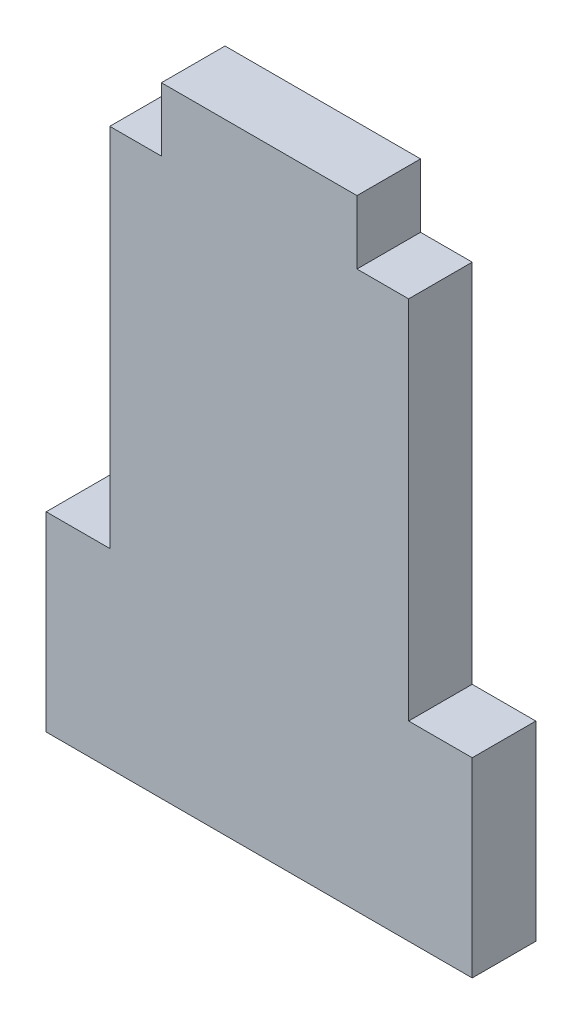
ISO-10303-21;
HEADER;
FILE_DESCRIPTION(('STEP AP214'),'2;1');
FILE_NAME('part.step','',(''),(''),'','','');
FILE_SCHEMA(('AUTOMOTIVE_DESIGN { 1 0 10303 214 1 1 1 1 }'));
ENDSEC;
DATA;
#1=APPLICATION_CONTEXT('core data for automotive mechanical design processes');
#2=APPLICATION_PROTOCOL_DEFINITION('international standard','automotive_design',2000,#1);
#3=PRODUCT_CONTEXT('',#1,'mechanical');
#4=PRODUCT('Part','Part','',(#3));
#5=PRODUCT_RELATED_PRODUCT_CATEGORY('part','',(#4));
#6=PRODUCT_DEFINITION_FORMATION('','',#4);
#7=PRODUCT_DEFINITION_CONTEXT('part definition',#1,'design');
#8=PRODUCT_DEFINITION('design','',#6,#7);
#9=PRODUCT_DEFINITION_SHAPE('','',#8);
#10=(LENGTH_UNIT() NAMED_UNIT(*) SI_UNIT(.MILLI.,.METRE.));
#11=(NAMED_UNIT(*) PLANE_ANGLE_UNIT() SI_UNIT($,.RADIAN.));
#12=(NAMED_UNIT(*) SI_UNIT($,.STERADIAN.) SOLID_ANGLE_UNIT());
#13=UNCERTAINTY_MEASURE_WITH_UNIT(LENGTH_MEASURE(1.E-05),#10,'distance_accuracy_value','');
#14=(GEOMETRIC_REPRESENTATION_CONTEXT(3) GLOBAL_UNCERTAINTY_ASSIGNED_CONTEXT((#13)) GLOBAL_UNIT_ASSIGNED_CONTEXT((#10,
#11,#12)) REPRESENTATION_CONTEXT('',''));
#15=CARTESIAN_POINT('',(0.,0.,0.));
#16=DIRECTION('',(0.,0.,1.));
#17=DIRECTION('',(1.,0.,0.));
#18=AXIS2_PLACEMENT_3D('',#15,#16,#17);
#19=CARTESIAN_POINT('',(-13.4,12.,4.));
#20=DIRECTION('',(0.,-1.,0.));
#21=DIRECTION('',(0.,0.,-1.));
#22=AXIS2_PLACEMENT_3D('',#19,#20,#21);
#23=PLANE('',#22);
#24=DIRECTION('',(-1.,0.,0.));
#25=VECTOR('',#24,1.);
#26=CARTESIAN_POINT('',(-13.4,12.,0.));
#27=LINE('',#26,#25);
#28=CARTESIAN_POINT('',(-9.4,12.,0.));
#29=VERTEX_POINT('',#28);
#30=CARTESIAN_POINT('',(-13.4,12.,0.));
#31=VERTEX_POINT('',#30);
#32=EDGE_CURVE('E153',#29,#31,#27,.T.);
#33=ORIENTED_EDGE('',*,*,#32,.T.);
#34=DIRECTION('',(0.,0.,-1.));
#35=VECTOR('',#34,1.);
#36=CARTESIAN_POINT('',(-13.4,12.,4.));
#37=LINE('',#36,#35);
#38=CARTESIAN_POINT('',(-13.4,12.,4.));
#39=VERTEX_POINT('',#38);
#40=EDGE_CURVE('E11',#39,#31,#37,.T.);
#41=ORIENTED_EDGE('',*,*,#40,.F.);
#42=DIRECTION('',(-1.,0.,0.));
#43=VECTOR('',#42,1.);
#44=CARTESIAN_POINT('',(-13.4,12.,4.));
#45=LINE('',#44,#43);
#46=CARTESIAN_POINT('',(-9.4,12.,4.));
#47=VERTEX_POINT('',#46);
#48=EDGE_CURVE('E175',#47,#39,#45,.T.);
#49=ORIENTED_EDGE('',*,*,#48,.F.);
#50=DIRECTION('',(0.,0.,-1.));
#51=VECTOR('',#50,1.);
#52=CARTESIAN_POINT('',(-9.4,12.,4.));
#53=LINE('',#52,#51);
#54=EDGE_CURVE('E149',#47,#29,#53,.T.);
#55=ORIENTED_EDGE('',*,*,#54,.T.);
#56=EDGE_LOOP('',(#33,#41,#49,#55));
#57=FACE_BOUND('',#56,.T.);
#58=ADVANCED_FACE('F33',(#57),#23,.F.);
#59=CARTESIAN_POINT('',(-13.4,0.,4.));
#60=DIRECTION('',(1.,0.,0.));
#61=DIRECTION('',(0.,0.,-1.));
#62=AXIS2_PLACEMENT_3D('',#59,#60,#61);
#63=PLANE('',#62);
#64=DIRECTION('',(0.,-1.,0.));
#65=VECTOR('',#64,1.);
#66=CARTESIAN_POINT('',(-13.4,0.,0.));
#67=LINE('',#66,#65);
#68=CARTESIAN_POINT('',(-13.4,0.,0.));
#69=VERTEX_POINT('',#68);
#70=EDGE_CURVE('E156',#31,#69,#67,.T.);
#71=ORIENTED_EDGE('',*,*,#70,.T.);
#72=DIRECTION('',(0.,0.,-1.));
#73=VECTOR('',#72,1.);
#74=CARTESIAN_POINT('',(-13.4,0.,4.));
#75=LINE('',#74,#73);
#76=CARTESIAN_POINT('',(-13.4,0.,4.));
#77=VERTEX_POINT('',#76);
#78=EDGE_CURVE('E41',#77,#69,#75,.T.);
#79=ORIENTED_EDGE('',*,*,#78,.F.);
#80=DIRECTION('',(0.,-1.,0.));
#81=VECTOR('',#80,1.);
#82=CARTESIAN_POINT('',(-13.4,0.,4.));
#83=LINE('',#82,#81);
#84=EDGE_CURVE('E104',#39,#77,#83,.T.);
#85=ORIENTED_EDGE('',*,*,#84,.F.);
#86=ORIENTED_EDGE('',*,*,#40,.T.);
#87=EDGE_LOOP('',(#71,#79,#85,#86));
#88=FACE_BOUND('',#87,.T.);
#89=ADVANCED_FACE('F253',(#88),#63,.F.);
#90=CARTESIAN_POINT('',(-13.4,0.,4.));
#91=DIRECTION('',(0.,1.,0.));
#92=DIRECTION('',(0.,0.,1.));
#93=AXIS2_PLACEMENT_3D('',#90,#91,#92);
#94=PLANE('',#93);
#95=DIRECTION('',(1.,0.,0.));
#96=VECTOR('',#95,1.);
#97=CARTESIAN_POINT('',(-13.4,0.,0.));
#98=LINE('',#97,#96);
#99=CARTESIAN_POINT('',(13.4,0.,0.));
#100=VERTEX_POINT('',#99);
#101=EDGE_CURVE('E158',#69,#100,#98,.T.);
#102=ORIENTED_EDGE('',*,*,#101,.T.);
#103=DIRECTION('',(0.,0.,-1.));
#104=VECTOR('',#103,1.);
#105=CARTESIAN_POINT('',(13.4,0.,4.));
#106=LINE('',#105,#104);
#107=CARTESIAN_POINT('',(13.4,0.,4.));
#108=VERTEX_POINT('',#107);
#109=EDGE_CURVE('E194',#108,#100,#106,.T.);
#110=ORIENTED_EDGE('',*,*,#109,.F.);
#111=DIRECTION('',(1.,0.,0.));
#112=VECTOR('',#111,1.);
#113=CARTESIAN_POINT('',(-13.4,0.,4.));
#114=LINE('',#113,#112);
#115=EDGE_CURVE('E202',#77,#108,#114,.T.);
#116=ORIENTED_EDGE('',*,*,#115,.F.);
#117=ORIENTED_EDGE('',*,*,#78,.T.);
#118=EDGE_LOOP('',(#102,#110,#116,#117));
#119=FACE_BOUND('',#118,.T.);
#120=ADVANCED_FACE('F200',(#119),#94,.F.);
#121=CARTESIAN_POINT('',(13.4,0.,4.));
#122=DIRECTION('',(-1.,0.,0.));
#123=DIRECTION('',(0.,0.,1.));
#124=AXIS2_PLACEMENT_3D('',#121,#122,#123);
#125=PLANE('',#124);
#126=DIRECTION('',(0.,1.,0.));
#127=VECTOR('',#126,1.);
#128=CARTESIAN_POINT('',(13.4,0.,0.));
#129=LINE('',#128,#127);
#130=CARTESIAN_POINT('',(13.4,12.,0.));
#131=VERTEX_POINT('',#130);
#132=EDGE_CURVE('E160',#100,#131,#129,.T.);
#133=ORIENTED_EDGE('',*,*,#132,.T.);
#134=DIRECTION('',(0.,0.,-1.));
#135=VECTOR('',#134,1.);
#136=CARTESIAN_POINT('',(13.4,12.,4.));
#137=LINE('',#136,#135);
#138=CARTESIAN_POINT('',(13.4,12.,4.));
#139=VERTEX_POINT('',#138);
#140=EDGE_CURVE('E191',#139,#131,#137,.T.);
#141=ORIENTED_EDGE('',*,*,#140,.F.);
#142=DIRECTION('',(0.,1.,0.));
#143=VECTOR('',#142,1.);
#144=CARTESIAN_POINT('',(13.4,0.,4.));
#145=LINE('',#144,#143);
#146=EDGE_CURVE('E220',#108,#139,#145,.T.);
#147=ORIENTED_EDGE('',*,*,#146,.F.);
#148=ORIENTED_EDGE('',*,*,#109,.T.);
#149=EDGE_LOOP('',(#133,#141,#147,#148));
#150=FACE_BOUND('',#149,.T.);
#151=ADVANCED_FACE('F211',(#150),#125,.F.);
#152=CARTESIAN_POINT('',(13.4,12.,4.));
#153=DIRECTION('',(0.,-1.,0.));
#154=DIRECTION('',(0.,0.,-1.));
#155=AXIS2_PLACEMENT_3D('',#152,#153,#154);
#156=PLANE('',#155);
#157=DIRECTION('',(-1.,0.,0.));
#158=VECTOR('',#157,1.);
#159=CARTESIAN_POINT('',(13.4,12.,0.));
#160=LINE('',#159,#158);
#161=CARTESIAN_POINT('',(9.4,12.,0.));
#162=VERTEX_POINT('',#161);
#163=EDGE_CURVE('E162',#131,#162,#160,.T.);
#164=ORIENTED_EDGE('',*,*,#163,.T.);
#165=DIRECTION('',(0.,0.,-1.));
#166=VECTOR('',#165,1.);
#167=CARTESIAN_POINT('',(9.4,12.,4.));
#168=LINE('',#167,#166);
#169=CARTESIAN_POINT('',(9.4,12.,4.));
#170=VERTEX_POINT('',#169);
#171=EDGE_CURVE('E188',#170,#162,#168,.T.);
#172=ORIENTED_EDGE('',*,*,#171,.F.);
#173=DIRECTION('',(-1.,0.,0.));
#174=VECTOR('',#173,1.);
#175=CARTESIAN_POINT('',(13.4,12.,4.));
#176=LINE('',#175,#174);
#177=EDGE_CURVE('E217',#139,#170,#176,.T.);
#178=ORIENTED_EDGE('',*,*,#177,.F.);
#179=ORIENTED_EDGE('',*,*,#140,.T.);
#180=EDGE_LOOP('',(#164,#172,#178,#179));
#181=FACE_BOUND('',#180,.T.);
#182=ADVANCED_FACE('F215',(#181),#156,.F.);
#183=CARTESIAN_POINT('',(9.4,12.,4.));
#184=DIRECTION('',(-1.,0.,0.));
#185=DIRECTION('',(0.,0.,1.));
#186=AXIS2_PLACEMENT_3D('',#183,#184,#185);
#187=PLANE('',#186);
#188=DIRECTION('',(0.,1.,0.));
#189=VECTOR('',#188,1.);
#190=CARTESIAN_POINT('',(9.4,12.,0.));
#191=LINE('',#190,#189);
#192=CARTESIAN_POINT('',(9.4,35.,0.));
#193=VERTEX_POINT('',#192);
#194=EDGE_CURVE('E164',#162,#193,#191,.T.);
#195=ORIENTED_EDGE('',*,*,#194,.T.);
#196=DIRECTION('',(0.,0.,-1.));
#197=VECTOR('',#196,1.);
#198=CARTESIAN_POINT('',(9.4,35.,4.));
#199=LINE('',#198,#197);
#200=CARTESIAN_POINT('',(9.4,35.,4.));
#201=VERTEX_POINT('',#200);
#202=EDGE_CURVE('E185',#201,#193,#199,.T.);
#203=ORIENTED_EDGE('',*,*,#202,.F.);
#204=DIRECTION('',(0.,1.,0.));
#205=VECTOR('',#204,1.);
#206=CARTESIAN_POINT('',(9.4,12.,4.));
#207=LINE('',#206,#205);
#208=EDGE_CURVE('E219',#170,#201,#207,.T.);
#209=ORIENTED_EDGE('',*,*,#208,.F.);
#210=ORIENTED_EDGE('',*,*,#171,.T.);
#211=EDGE_LOOP('',(#195,#203,#209,#210));
#212=FACE_BOUND('',#211,.T.);
#213=ADVANCED_FACE('F266',(#212),#187,.F.);
#214=CARTESIAN_POINT('',(9.4,35.,4.));
#215=DIRECTION('',(0.,-1.,0.));
#216=DIRECTION('',(0.,0.,-1.));
#217=AXIS2_PLACEMENT_3D('',#214,#215,#216);
#218=PLANE('',#217);
#219=DIRECTION('',(-1.,0.,0.));
#220=VECTOR('',#219,1.);
#221=CARTESIAN_POINT('',(9.4,35.,0.));
#222=LINE('',#221,#220);
#223=CARTESIAN_POINT('',(6.15,35.,0.));
#224=VERTEX_POINT('',#223);
#225=EDGE_CURVE('E166',#193,#224,#222,.T.);
#226=ORIENTED_EDGE('',*,*,#225,.T.);
#227=DIRECTION('',(0.,0.,-1.));
#228=VECTOR('',#227,1.);
#229=CARTESIAN_POINT('',(6.15,35.,4.));
#230=LINE('',#229,#228);
#231=CARTESIAN_POINT('',(6.15,35.,4.));
#232=VERTEX_POINT('',#231);
#233=EDGE_CURVE('E182',#232,#224,#230,.T.);
#234=ORIENTED_EDGE('',*,*,#233,.F.);
#235=DIRECTION('',(-1.,0.,0.));
#236=VECTOR('',#235,1.);
#237=CARTESIAN_POINT('',(9.4,35.,4.));
#238=LINE('',#237,#236);
#239=EDGE_CURVE('E222',#201,#232,#238,.T.);
#240=ORIENTED_EDGE('',*,*,#239,.F.);
#241=ORIENTED_EDGE('',*,*,#202,.T.);
#242=EDGE_LOOP('',(#226,#234,#240,#241));
#243=FACE_BOUND('',#242,.T.);
#244=ADVANCED_FACE('F269',(#243),#218,.F.);
#245=CARTESIAN_POINT('',(6.15,35.,4.));
#246=DIRECTION('',(-1.,0.,0.));
#247=DIRECTION('',(0.,0.,1.));
#248=AXIS2_PLACEMENT_3D('',#245,#246,#247);
#249=PLANE('',#248);
#250=DIRECTION('',(0.,1.,0.));
#251=VECTOR('',#250,1.);
#252=CARTESIAN_POINT('',(6.15,35.,0.));
#253=LINE('',#252,#251);
#254=CARTESIAN_POINT('',(6.15,39.,0.));
#255=VERTEX_POINT('',#254);
#256=EDGE_CURVE('E168',#224,#255,#253,.T.);
#257=ORIENTED_EDGE('',*,*,#256,.T.);
#258=DIRECTION('',(0.,0.,-1.));
#259=VECTOR('',#258,1.);
#260=CARTESIAN_POINT('',(6.15,39.,4.));
#261=LINE('',#260,#259);
#262=CARTESIAN_POINT('',(6.15,39.,4.));
#263=VERTEX_POINT('',#262);
#264=EDGE_CURVE('E179',#263,#255,#261,.T.);
#265=ORIENTED_EDGE('',*,*,#264,.F.);
#266=DIRECTION('',(0.,1.,0.));
#267=VECTOR('',#266,1.);
#268=CARTESIAN_POINT('',(6.15,35.,4.));
#269=LINE('',#268,#267);
#270=EDGE_CURVE('E228',#232,#263,#269,.T.);
#271=ORIENTED_EDGE('',*,*,#270,.F.);
#272=ORIENTED_EDGE('',*,*,#233,.T.);
#273=EDGE_LOOP('',(#257,#265,#271,#272));
#274=FACE_BOUND('',#273,.T.);
#275=ADVANCED_FACE('F234',(#274),#249,.F.);
#276=CARTESIAN_POINT('',(-6.15,39.,4.));
#277=DIRECTION('',(0.,-1.,0.));
#278=DIRECTION('',(0.,0.,-1.));
#279=AXIS2_PLACEMENT_3D('',#276,#277,#278);
#280=PLANE('',#279);
#281=DIRECTION('',(-1.,0.,0.));
#282=VECTOR('',#281,1.);
#283=CARTESIAN_POINT('',(-6.15,39.,0.));
#284=LINE('',#283,#282);
#285=CARTESIAN_POINT('',(-6.15,39.,0.));
#286=VERTEX_POINT('',#285);
#287=EDGE_CURVE('E170',#255,#286,#284,.T.);
#288=ORIENTED_EDGE('',*,*,#287,.T.);
#289=DIRECTION('',(0.,0.,-1.));
#290=VECTOR('',#289,1.);
#291=CARTESIAN_POINT('',(-6.15,39.,4.));
#292=LINE('',#291,#290);
#293=CARTESIAN_POINT('',(-6.15,39.,4.));
#294=VERTEX_POINT('',#293);
#295=EDGE_CURVE('E144',#294,#286,#292,.T.);
#296=ORIENTED_EDGE('',*,*,#295,.F.);
#297=DIRECTION('',(-1.,0.,0.));
#298=VECTOR('',#297,1.);
#299=CARTESIAN_POINT('',(-6.15,39.,4.));
#300=LINE('',#299,#298);
#301=EDGE_CURVE('E135',#263,#294,#300,.T.);
#302=ORIENTED_EDGE('',*,*,#301,.F.);
#303=ORIENTED_EDGE('',*,*,#264,.T.);
#304=EDGE_LOOP('',(#288,#296,#302,#303));
#305=FACE_BOUND('',#304,.T.);
#306=ADVANCED_FACE('F238',(#305),#280,.F.);
#307=CARTESIAN_POINT('',(-6.15,35.,4.));
#308=DIRECTION('',(1.,0.,0.));
#309=DIRECTION('',(0.,0.,-1.));
#310=AXIS2_PLACEMENT_3D('',#307,#308,#309);
#311=PLANE('',#310);
#312=DIRECTION('',(0.,-1.,0.));
#313=VECTOR('',#312,1.);
#314=CARTESIAN_POINT('',(-6.15,35.,0.));
#315=LINE('',#314,#313);
#316=CARTESIAN_POINT('',(-6.15,35.,0.));
#317=VERTEX_POINT('',#316);
#318=EDGE_CURVE('E143',#286,#317,#315,.T.);
#319=ORIENTED_EDGE('',*,*,#318,.T.);
#320=DIRECTION('',(0.,0.,-1.));
#321=VECTOR('',#320,1.);
#322=CARTESIAN_POINT('',(-6.15,35.,4.));
#323=LINE('',#322,#321);
#324=CARTESIAN_POINT('',(-6.15,35.,4.));
#325=VERTEX_POINT('',#324);
#326=EDGE_CURVE('E140',#325,#317,#323,.T.);
#327=ORIENTED_EDGE('',*,*,#326,.F.);
#328=DIRECTION('',(0.,-1.,0.));
#329=VECTOR('',#328,1.);
#330=CARTESIAN_POINT('',(-6.15,35.,4.));
#331=LINE('',#330,#329);
#332=EDGE_CURVE('E129',#294,#325,#331,.T.);
#333=ORIENTED_EDGE('',*,*,#332,.F.);
#334=ORIENTED_EDGE('',*,*,#295,.T.);
#335=EDGE_LOOP('',(#319,#327,#333,#334));
#336=FACE_BOUND('',#335,.T.);
#337=ADVANCED_FACE('F141',(#336),#311,.F.);
#338=CARTESIAN_POINT('',(-9.4,35.,4.));
#339=DIRECTION('',(0.,-1.,0.));
#340=DIRECTION('',(0.,0.,-1.));
#341=AXIS2_PLACEMENT_3D('',#338,#339,#340);
#342=PLANE('',#341);
#343=DIRECTION('',(-1.,0.,0.));
#344=VECTOR('',#343,1.);
#345=CARTESIAN_POINT('',(-9.4,35.,0.));
#346=LINE('',#345,#344);
#347=CARTESIAN_POINT('',(-9.4,35.,0.));
#348=VERTEX_POINT('',#347);
#349=EDGE_CURVE('E90',#317,#348,#346,.T.);
#350=ORIENTED_EDGE('',*,*,#349,.T.);
#351=DIRECTION('',(0.,0.,-1.));
#352=VECTOR('',#351,1.);
#353=CARTESIAN_POINT('',(-9.4,35.,4.));
#354=LINE('',#353,#352);
#355=CARTESIAN_POINT('',(-9.4,35.,4.));
#356=VERTEX_POINT('',#355);
#357=EDGE_CURVE('E145',#356,#348,#354,.T.);
#358=ORIENTED_EDGE('',*,*,#357,.F.);
#359=DIRECTION('',(-1.,0.,0.));
#360=VECTOR('',#359,1.);
#361=CARTESIAN_POINT('',(-9.4,35.,4.));
#362=LINE('',#361,#360);
#363=EDGE_CURVE('E133',#325,#356,#362,.T.);
#364=ORIENTED_EDGE('',*,*,#363,.F.);
#365=ORIENTED_EDGE('',*,*,#326,.T.);
#366=EDGE_LOOP('',(#350,#358,#364,#365));
#367=FACE_BOUND('',#366,.T.);
#368=ADVANCED_FACE('F147',(#367),#342,.F.);
#369=CARTESIAN_POINT('',(-9.4,12.,4.));
#370=DIRECTION('',(1.,0.,0.));
#371=DIRECTION('',(0.,0.,-1.));
#372=AXIS2_PLACEMENT_3D('',#369,#370,#371);
#373=PLANE('',#372);
#374=DIRECTION('',(0.,-1.,0.));
#375=VECTOR('',#374,1.);
#376=CARTESIAN_POINT('',(-9.4,12.,0.));
#377=LINE('',#376,#375);
#378=EDGE_CURVE('E96',#348,#29,#377,.T.);
#379=ORIENTED_EDGE('',*,*,#378,.T.);
#380=ORIENTED_EDGE('',*,*,#54,.F.);
#381=DIRECTION('',(0.,-1.,0.));
#382=VECTOR('',#381,1.);
#383=CARTESIAN_POINT('',(-9.4,12.,4.));
#384=LINE('',#383,#382);
#385=EDGE_CURVE('E49',#356,#47,#384,.T.);
#386=ORIENTED_EDGE('',*,*,#385,.F.);
#387=ORIENTED_EDGE('',*,*,#357,.T.);
#388=EDGE_LOOP('',(#379,#380,#386,#387));
#389=FACE_BOUND('',#388,.T.);
#390=ADVANCED_FACE('F242',(#389),#373,.F.);
#391=CARTESIAN_POINT('',(0.,0.,4.));
#392=DIRECTION('',(0.,0.,1.));
#393=DIRECTION('',(1.,0.,0.));
#394=AXIS2_PLACEMENT_3D('',#391,#392,#393);
#395=PLANE('',#394);
#396=ORIENTED_EDGE('',*,*,#48,.T.);
#397=ORIENTED_EDGE('',*,*,#84,.T.);
#398=ORIENTED_EDGE('',*,*,#115,.T.);
#399=ORIENTED_EDGE('',*,*,#146,.T.);
#400=ORIENTED_EDGE('',*,*,#177,.T.);
#401=ORIENTED_EDGE('',*,*,#208,.T.);
#402=ORIENTED_EDGE('',*,*,#239,.T.);
#403=ORIENTED_EDGE('',*,*,#270,.T.);
#404=ORIENTED_EDGE('',*,*,#301,.T.);
#405=ORIENTED_EDGE('',*,*,#332,.T.);
#406=ORIENTED_EDGE('',*,*,#363,.T.);
#407=ORIENTED_EDGE('',*,*,#385,.T.);
#408=EDGE_LOOP('',(#396,#397,#398,#399,#400,#401,#402,#403,#404,#405,#406,#407));
#409=FACE_BOUND('',#408,.T.);
#410=ADVANCED_FACE('F131',(#409),#395,.T.);
#411=CARTESIAN_POINT('',(0.,0.,0.));
#412=DIRECTION('',(0.,0.,1.));
#413=DIRECTION('',(1.,0.,0.));
#414=AXIS2_PLACEMENT_3D('',#411,#412,#413);
#415=PLANE('',#414);
#416=ORIENTED_EDGE('',*,*,#32,.F.);
#417=ORIENTED_EDGE('',*,*,#378,.F.);
#418=ORIENTED_EDGE('',*,*,#349,.F.);
#419=ORIENTED_EDGE('',*,*,#318,.F.);
#420=ORIENTED_EDGE('',*,*,#287,.F.);
#421=ORIENTED_EDGE('',*,*,#256,.F.);
#422=ORIENTED_EDGE('',*,*,#225,.F.);
#423=ORIENTED_EDGE('',*,*,#194,.F.);
#424=ORIENTED_EDGE('',*,*,#163,.F.);
#425=ORIENTED_EDGE('',*,*,#132,.F.);
#426=ORIENTED_EDGE('',*,*,#101,.F.);
#427=ORIENTED_EDGE('',*,*,#70,.F.);
#428=EDGE_LOOP('',(#416,#417,#418,#419,#420,#421,#422,#423,#424,#425,#426,#427));
#429=FACE_BOUND('',#428,.T.);
#430=ADVANCED_FACE('F206',(#429),#415,.F.);
#431=CLOSED_SHELL('',(#58,#89,#120,#151,#182,#213,#244,#275,#306,#337,#368,#390,#410,#430));
#432=MANIFOLD_SOLID_BREP('B2',#431);
#433=ADVANCED_BREP_SHAPE_REPRESENTATION('',(#18,#432),#14);
#434=SHAPE_DEFINITION_REPRESENTATION(#9,#433);
ENDSEC;
END-ISO-10303-21;
